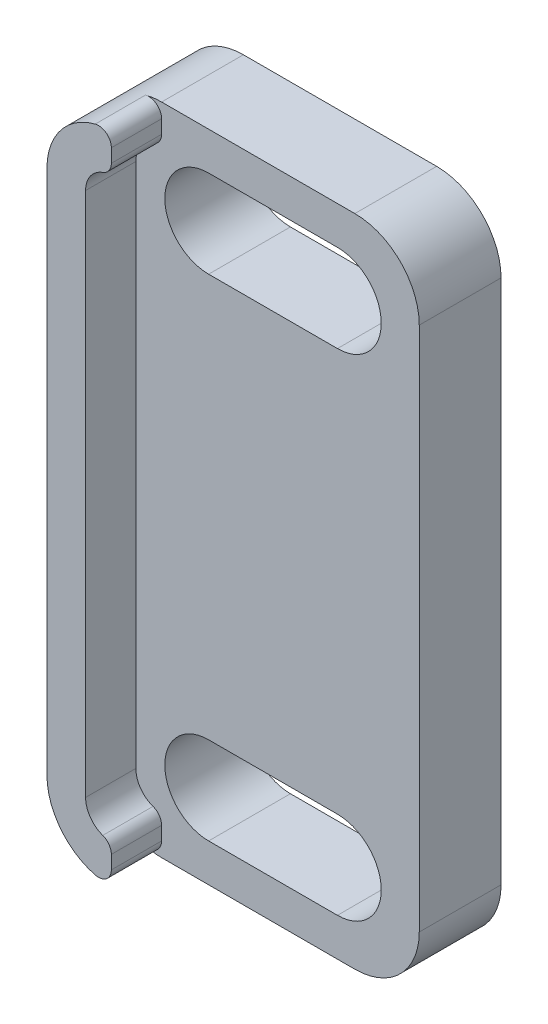
ISO-10303-21;
HEADER;
FILE_DESCRIPTION(('STEP AP214'),'2;1');
FILE_NAME('part.step','',(''),(''),'','','');
FILE_SCHEMA(('AUTOMOTIVE_DESIGN { 1 0 10303 214 1 1 1 1 }'));
ENDSEC;
DATA;
#1=APPLICATION_CONTEXT('core data for automotive mechanical design processes');
#2=APPLICATION_PROTOCOL_DEFINITION('international standard','automotive_design',2000,#1);
#3=PRODUCT_CONTEXT('',#1,'mechanical');
#4=PRODUCT('Part','Part','',(#3));
#5=PRODUCT_RELATED_PRODUCT_CATEGORY('part','',(#4));
#6=PRODUCT_DEFINITION_FORMATION('','',#4);
#7=PRODUCT_DEFINITION_CONTEXT('part definition',#1,'design');
#8=PRODUCT_DEFINITION('design','',#6,#7);
#9=PRODUCT_DEFINITION_SHAPE('','',#8);
#10=(LENGTH_UNIT() NAMED_UNIT(*) SI_UNIT(.MILLI.,.METRE.));
#11=(NAMED_UNIT(*) PLANE_ANGLE_UNIT() SI_UNIT($,.RADIAN.));
#12=(NAMED_UNIT(*) SI_UNIT($,.STERADIAN.) SOLID_ANGLE_UNIT());
#13=UNCERTAINTY_MEASURE_WITH_UNIT(LENGTH_MEASURE(1.E-05),#10,'distance_accuracy_value','');
#14=(GEOMETRIC_REPRESENTATION_CONTEXT(3) GLOBAL_UNCERTAINTY_ASSIGNED_CONTEXT((#13)) GLOBAL_UNIT_ASSIGNED_CONTEXT((#10,
#11,#12)) REPRESENTATION_CONTEXT('',''));
#15=CARTESIAN_POINT('',(0.,0.,0.));
#16=DIRECTION('',(0.,0.,1.));
#17=DIRECTION('',(1.,0.,0.));
#18=AXIS2_PLACEMENT_3D('',#15,#16,#17);
#19=CARTESIAN_POINT('',(0.,0.,3.175));
#20=DIRECTION('',(0.,0.,-1.));
#21=DIRECTION('',(-1.,0.,0.));
#22=AXIS2_PLACEMENT_3D('',#19,#20,#21);
#23=PLANE('',#22);
#24=CARTESIAN_POINT('',(4.325,22.225,3.175));
#25=DIRECTION('',(0.,0.,1.));
#26=DIRECTION('',(1.,0.,0.));
#27=AXIS2_PLACEMENT_3D('',#24,#25,#26);
#28=CIRCLE('',#27,1.7);
#29=CARTESIAN_POINT('',(4.325,23.925,3.175));
#30=VERTEX_POINT('',#29);
#31=CARTESIAN_POINT('',(4.325,20.525,3.175));
#32=VERTEX_POINT('',#31);
#33=EDGE_CURVE('E270',#30,#32,#28,.T.);
#34=ORIENTED_EDGE('',*,*,#33,.F.);
#35=DIRECTION('',(-1.,0.,0.));
#36=VECTOR('',#35,1.);
#37=CARTESIAN_POINT('',(4.325,23.925,3.175));
#38=LINE('',#37,#36);
#39=CARTESIAN_POINT('',(9.325,23.925,3.175));
#40=VERTEX_POINT('',#39);
#41=EDGE_CURVE('E278',#40,#30,#38,.T.);
#42=ORIENTED_EDGE('',*,*,#41,.F.);
#43=CARTESIAN_POINT('',(9.325,22.225,3.175));
#44=DIRECTION('',(0.,0.,1.));
#45=DIRECTION('',(1.,0.,0.));
#46=AXIS2_PLACEMENT_3D('',#43,#44,#45);
#47=CIRCLE('',#46,1.7);
#48=CARTESIAN_POINT('',(9.325,20.525,3.175));
#49=VERTEX_POINT('',#48);
#50=EDGE_CURVE('E275',#49,#40,#47,.T.);
#51=ORIENTED_EDGE('',*,*,#50,.F.);
#52=DIRECTION('',(1.,0.,0.));
#53=VECTOR('',#52,1.);
#54=CARTESIAN_POINT('',(4.325,20.525,3.175));
#55=LINE('',#54,#53);
#56=EDGE_CURVE('E272',#32,#49,#55,.T.);
#57=ORIENTED_EDGE('',*,*,#56,.F.);
#58=EDGE_LOOP('',(#34,#42,#51,#57));
#59=FACE_BOUND('',#58,.T.);
#60=CARTESIAN_POINT('',(4.325,3.175,3.175));
#61=DIRECTION('',(0.,0.,1.));
#62=DIRECTION('',(1.,0.,0.));
#63=AXIS2_PLACEMENT_3D('',#60,#61,#62);
#64=CIRCLE('',#63,1.7);
#65=CARTESIAN_POINT('',(4.325,4.875,3.175));
#66=VERTEX_POINT('',#65);
#67=CARTESIAN_POINT('',(4.325,1.475,3.175));
#68=VERTEX_POINT('',#67);
#69=EDGE_CURVE('E301',#66,#68,#64,.T.);
#70=ORIENTED_EDGE('',*,*,#69,.F.);
#71=DIRECTION('',(-1.,0.,0.));
#72=VECTOR('',#71,1.);
#73=CARTESIAN_POINT('',(4.325,4.875,3.175));
#74=LINE('',#73,#72);
#75=CARTESIAN_POINT('',(9.325,4.875,3.175));
#76=VERTEX_POINT('',#75);
#77=EDGE_CURVE('E309',#76,#66,#74,.T.);
#78=ORIENTED_EDGE('',*,*,#77,.F.);
#79=CARTESIAN_POINT('',(9.325,3.175,3.175));
#80=DIRECTION('',(0.,0.,1.));
#81=DIRECTION('',(1.,0.,0.));
#82=AXIS2_PLACEMENT_3D('',#79,#80,#81);
#83=CIRCLE('',#82,1.7);
#84=CARTESIAN_POINT('',(9.325,1.475,3.175));
#85=VERTEX_POINT('',#84);
#86=EDGE_CURVE('E306',#85,#76,#83,.T.);
#87=ORIENTED_EDGE('',*,*,#86,.F.);
#88=DIRECTION('',(1.,0.,0.));
#89=VECTOR('',#88,1.);
#90=CARTESIAN_POINT('',(4.325,1.475,3.175));
#91=LINE('',#90,#89);
#92=EDGE_CURVE('E303',#68,#85,#91,.T.);
#93=ORIENTED_EDGE('',*,*,#92,.F.);
#94=EDGE_LOOP('',(#70,#78,#87,#93));
#95=FACE_BOUND('',#94,.T.);
#96=DIRECTION('',(0.,1.,0.));
#97=VECTOR('',#96,1.);
#98=CARTESIAN_POINT('',(2.5,23.9,3.175));
#99=LINE('',#98,#97);
#100=CARTESIAN_POINT('',(2.5,24.3142135623731,3.175));
#101=VERTEX_POINT('',#100);
#102=CARTESIAN_POINT('',(2.5,24.8364916731037,3.175));
#103=VERTEX_POINT('',#102);
#104=EDGE_CURVE('E219',#101,#103,#99,.T.);
#105=ORIENTED_EDGE('',*,*,#104,.F.);
#106=CARTESIAN_POINT('',(2.,24.3142135623731,3.175));
#107=DIRECTION('',(0.,0.,-1.));
#108=DIRECTION('',(-1.,0.,0.));
#109=AXIS2_PLACEMENT_3D('',#106,#107,#108);
#110=CIRCLE('',#109,0.5);
#111=CARTESIAN_POINT('',(2.16666666666667,23.8428090415821,3.175));
#112=VERTEX_POINT('',#111);
#113=EDGE_CURVE('E42',#101,#112,#110,.T.);
#114=ORIENTED_EDGE('',*,*,#113,.T.);
#115=CARTESIAN_POINT('',(2.5,22.9,3.175));
#116=DIRECTION('',(0.,0.,1.));
#117=DIRECTION('',(1.,0.,0.));
#118=AXIS2_PLACEMENT_3D('',#115,#116,#117);
#119=CIRCLE('',#118,1.);
#120=CARTESIAN_POINT('',(1.5,22.9,3.175));
#121=VERTEX_POINT('',#120);
#122=EDGE_CURVE('E261',#112,#121,#119,.T.);
#123=ORIENTED_EDGE('',*,*,#122,.T.);
#124=DIRECTION('',(0.,-1.,0.));
#125=VECTOR('',#124,1.);
#126=CARTESIAN_POINT('',(1.5,22.9,3.175));
#127=LINE('',#126,#125);
#128=CARTESIAN_POINT('',(1.5,2.5,3.175));
#129=VERTEX_POINT('',#128);
#130=EDGE_CURVE('E258',#121,#129,#127,.T.);
#131=ORIENTED_EDGE('',*,*,#130,.T.);
#132=CARTESIAN_POINT('',(2.5,2.5,3.175));
#133=DIRECTION('',(0.,0.,1.));
#134=DIRECTION('',(1.,0.,0.));
#135=AXIS2_PLACEMENT_3D('',#132,#133,#134);
#136=CIRCLE('',#135,1.);
#137=CARTESIAN_POINT('',(2.16666666666667,1.55719095841794,3.175));
#138=VERTEX_POINT('',#137);
#139=EDGE_CURVE('E255',#129,#138,#136,.T.);
#140=ORIENTED_EDGE('',*,*,#139,.T.);
#141=CARTESIAN_POINT('',(2.,1.08578643762691,3.175));
#142=DIRECTION('',(0.,0.,-1.));
#143=DIRECTION('',(-1.,0.,0.));
#144=AXIS2_PLACEMENT_3D('',#141,#142,#143);
#145=CIRCLE('',#144,0.5);
#146=CARTESIAN_POINT('',(2.5,1.08578643762691,3.175));
#147=VERTEX_POINT('',#146);
#148=EDGE_CURVE('E408',#138,#147,#145,.T.);
#149=ORIENTED_EDGE('',*,*,#148,.T.);
#150=DIRECTION('',(0.,-1.,0.));
#151=VECTOR('',#150,1.);
#152=CARTESIAN_POINT('',(2.5,1.5,3.175));
#153=LINE('',#152,#151);
#154=CARTESIAN_POINT('',(2.5,0.563508326896292,3.175));
#155=VERTEX_POINT('',#154);
#156=EDGE_CURVE('E252',#147,#155,#153,.T.);
#157=ORIENTED_EDGE('',*,*,#156,.T.);
#158=CARTESIAN_POINT('',(2.,0.563508326896292,3.175));
#159=DIRECTION('',(0.,0.,-1.));
#160=DIRECTION('',(-1.,0.,0.));
#161=AXIS2_PLACEMENT_3D('',#158,#159,#160);
#162=CIRCLE('',#161,0.5);
#163=CARTESIAN_POINT('',(1.875,0.0793854086203644,3.175));
#164=VERTEX_POINT('',#163);
#165=EDGE_CURVE('E406',#155,#164,#162,.T.);
#166=ORIENTED_EDGE('',*,*,#165,.T.);
#167=CARTESIAN_POINT('',(2.5,2.5,3.175));
#168=DIRECTION('',(0.,0.,-1.));
#169=DIRECTION('',(-1.,0.,0.));
#170=AXIS2_PLACEMENT_3D('',#167,#168,#169);
#171=CIRCLE('',#170,2.5);
#172=CARTESIAN_POINT('',(2.5,0.,3.175));
#173=VERTEX_POINT('',#172);
#174=EDGE_CURVE('E49',#173,#164,#171,.T.);
#175=ORIENTED_EDGE('',*,*,#174,.F.);
#176=DIRECTION('',(1.,0.,0.));
#177=VECTOR('',#176,1.);
#178=CARTESIAN_POINT('',(0.,0.,3.175));
#179=LINE('',#178,#177);
#180=CARTESIAN_POINT('',(10.,0.,3.175));
#181=VERTEX_POINT('',#180);
#182=EDGE_CURVE('E332',#173,#181,#179,.T.);
#183=ORIENTED_EDGE('',*,*,#182,.T.);
#184=CARTESIAN_POINT('',(10.,2.5,3.175));
#185=DIRECTION('',(0.,0.,-1.));
#186=DIRECTION('',(-1.,0.,0.));
#187=AXIS2_PLACEMENT_3D('',#184,#185,#186);
#188=CIRCLE('',#187,2.5);
#189=CARTESIAN_POINT('',(12.5,2.5,3.175));
#190=VERTEX_POINT('',#189);
#191=EDGE_CURVE('E364',#181,#190,#188,.F.);
#192=ORIENTED_EDGE('',*,*,#191,.T.);
#193=DIRECTION('',(0.,1.,0.));
#194=VECTOR('',#193,1.);
#195=CARTESIAN_POINT('',(12.5,0.,3.175));
#196=LINE('',#195,#194);
#197=CARTESIAN_POINT('',(12.5,22.9,3.175));
#198=VERTEX_POINT('',#197);
#199=EDGE_CURVE('E334',#190,#198,#196,.T.);
#200=ORIENTED_EDGE('',*,*,#199,.T.);
#201=CARTESIAN_POINT('',(10.,22.9,3.175));
#202=DIRECTION('',(0.,0.,-1.));
#203=DIRECTION('',(-1.,0.,0.));
#204=AXIS2_PLACEMENT_3D('',#201,#202,#203);
#205=CIRCLE('',#204,2.5);
#206=CARTESIAN_POINT('',(10.,25.4,3.175));
#207=VERTEX_POINT('',#206);
#208=EDGE_CURVE('E362',#198,#207,#205,.F.);
#209=ORIENTED_EDGE('',*,*,#208,.T.);
#210=DIRECTION('',(-1.,0.,0.));
#211=VECTOR('',#210,1.);
#212=CARTESIAN_POINT('',(0.,25.4,3.175));
#213=LINE('',#212,#211);
#214=CARTESIAN_POINT('',(2.5,25.4,3.175));
#215=VERTEX_POINT('',#214);
#216=EDGE_CURVE('E338',#207,#215,#213,.T.);
#217=ORIENTED_EDGE('',*,*,#216,.T.);
#218=CARTESIAN_POINT('',(2.5,22.9,3.175));
#219=DIRECTION('',(0.,0.,-1.));
#220=DIRECTION('',(-1.,0.,0.));
#221=AXIS2_PLACEMENT_3D('',#218,#219,#220);
#222=CIRCLE('',#221,2.5);
#223=CARTESIAN_POINT('',(1.875,25.3206145913796,3.175));
#224=VERTEX_POINT('',#223);
#225=EDGE_CURVE('E402',#224,#215,#222,.T.);
#226=ORIENTED_EDGE('',*,*,#225,.F.);
#227=CARTESIAN_POINT('',(2.,24.8364916731037,3.175));
#228=DIRECTION('',(0.,0.,-1.));
#229=DIRECTION('',(-1.,0.,0.));
#230=AXIS2_PLACEMENT_3D('',#227,#228,#229);
#231=CIRCLE('',#230,0.5);
#232=EDGE_CURVE('E11',#224,#103,#231,.T.);
#233=ORIENTED_EDGE('',*,*,#232,.T.);
#234=EDGE_LOOP('',(#105,#114,#123,#131,#140,#149,#157,#166,#175,#183,#192,#200,#209,#217,#226,#233));
#235=FACE_BOUND('',#234,.T.);
#236=ADVANCED_FACE('F34',(#59,#95,#235),#23,.F.);
#237=CARTESIAN_POINT('',(0.,0.,0.));
#238=DIRECTION('',(0.,0.,-1.));
#239=DIRECTION('',(-1.,0.,0.));
#240=AXIS2_PLACEMENT_3D('',#237,#238,#239);
#241=PLANE('',#240);
#242=DIRECTION('',(1.,0.,0.));
#243=VECTOR('',#242,1.);
#244=CARTESIAN_POINT('',(0.,0.,0.));
#245=LINE('',#244,#243);
#246=CARTESIAN_POINT('',(2.5,0.,0.));
#247=VERTEX_POINT('',#246);
#248=CARTESIAN_POINT('',(10.,0.,0.));
#249=VERTEX_POINT('',#248);
#250=EDGE_CURVE('E343',#247,#249,#245,.T.);
#251=ORIENTED_EDGE('',*,*,#250,.F.);
#252=CARTESIAN_POINT('',(2.5,2.5,0.));
#253=DIRECTION('',(0.,0.,-1.));
#254=DIRECTION('',(-1.,0.,0.));
#255=AXIS2_PLACEMENT_3D('',#252,#253,#254);
#256=CIRCLE('',#255,2.5);
#257=CARTESIAN_POINT('',(0.,2.5,0.));
#258=VERTEX_POINT('',#257);
#259=EDGE_CURVE('E230',#247,#258,#256,.T.);
#260=ORIENTED_EDGE('',*,*,#259,.T.);
#261=DIRECTION('',(0.,-1.,0.));
#262=VECTOR('',#261,1.);
#263=CARTESIAN_POINT('',(0.,0.,0.));
#264=LINE('',#263,#262);
#265=CARTESIAN_POINT('',(0.,22.9,0.));
#266=VERTEX_POINT('',#265);
#267=EDGE_CURVE('E331',#266,#258,#264,.T.);
#268=ORIENTED_EDGE('',*,*,#267,.F.);
#269=CARTESIAN_POINT('',(2.5,22.9,0.));
#270=DIRECTION('',(0.,0.,-1.));
#271=DIRECTION('',(-1.,0.,0.));
#272=AXIS2_PLACEMENT_3D('',#269,#270,#271);
#273=CIRCLE('',#272,2.5);
#274=CARTESIAN_POINT('',(2.5,25.4,0.));
#275=VERTEX_POINT('',#274);
#276=EDGE_CURVE('E225',#266,#275,#273,.T.);
#277=ORIENTED_EDGE('',*,*,#276,.T.);
#278=DIRECTION('',(-1.,0.,0.));
#279=VECTOR('',#278,1.);
#280=CARTESIAN_POINT('',(0.,25.4,0.));
#281=LINE('',#280,#279);
#282=CARTESIAN_POINT('',(10.,25.4,0.));
#283=VERTEX_POINT('',#282);
#284=EDGE_CURVE('E335',#283,#275,#281,.T.);
#285=ORIENTED_EDGE('',*,*,#284,.F.);
#286=CARTESIAN_POINT('',(10.,22.9,0.));
#287=DIRECTION('',(0.,0.,-1.));
#288=DIRECTION('',(-1.,0.,0.));
#289=AXIS2_PLACEMENT_3D('',#286,#287,#288);
#290=CIRCLE('',#289,2.5);
#291=CARTESIAN_POINT('',(12.5,22.9,0.));
#292=VERTEX_POINT('',#291);
#293=EDGE_CURVE('E356',#283,#292,#290,.T.);
#294=ORIENTED_EDGE('',*,*,#293,.T.);
#295=DIRECTION('',(0.,1.,0.));
#296=VECTOR('',#295,1.);
#297=CARTESIAN_POINT('',(12.5,0.,0.));
#298=LINE('',#297,#296);
#299=CARTESIAN_POINT('',(12.5,2.5,0.));
#300=VERTEX_POINT('',#299);
#301=EDGE_CURVE('E346',#300,#292,#298,.T.);
#302=ORIENTED_EDGE('',*,*,#301,.F.);
#303=CARTESIAN_POINT('',(10.,2.5,0.));
#304=DIRECTION('',(0.,0.,-1.));
#305=DIRECTION('',(-1.,0.,0.));
#306=AXIS2_PLACEMENT_3D('',#303,#304,#305);
#307=CIRCLE('',#306,2.5);
#308=EDGE_CURVE('E358',#300,#249,#307,.T.);
#309=ORIENTED_EDGE('',*,*,#308,.T.);
#310=EDGE_LOOP('',(#251,#260,#268,#277,#285,#294,#302,#309));
#311=FACE_BOUND('',#310,.T.);
#312=DIRECTION('',(-1.,0.,0.));
#313=VECTOR('',#312,1.);
#314=CARTESIAN_POINT('',(4.325,4.875,0.));
#315=LINE('',#314,#313);
#316=CARTESIAN_POINT('',(9.325,4.875,0.));
#317=VERTEX_POINT('',#316);
#318=CARTESIAN_POINT('',(4.325,4.875,0.));
#319=VERTEX_POINT('',#318);
#320=EDGE_CURVE('E304',#317,#319,#315,.T.);
#321=ORIENTED_EDGE('',*,*,#320,.T.);
#322=CARTESIAN_POINT('',(4.325,3.175,0.));
#323=DIRECTION('',(0.,0.,1.));
#324=DIRECTION('',(1.,0.,0.));
#325=AXIS2_PLACEMENT_3D('',#322,#323,#324);
#326=CIRCLE('',#325,1.7);
#327=CARTESIAN_POINT('',(4.325,1.475,0.));
#328=VERTEX_POINT('',#327);
#329=EDGE_CURVE('E300',#319,#328,#326,.T.);
#330=ORIENTED_EDGE('',*,*,#329,.T.);
#331=DIRECTION('',(1.,0.,0.));
#332=VECTOR('',#331,1.);
#333=CARTESIAN_POINT('',(4.325,1.475,0.));
#334=LINE('',#333,#332);
#335=CARTESIAN_POINT('',(9.325,1.475,0.));
#336=VERTEX_POINT('',#335);
#337=EDGE_CURVE('E314',#328,#336,#334,.T.);
#338=ORIENTED_EDGE('',*,*,#337,.T.);
#339=CARTESIAN_POINT('',(9.325,3.175,0.));
#340=DIRECTION('',(0.,0.,1.));
#341=DIRECTION('',(1.,0.,0.));
#342=AXIS2_PLACEMENT_3D('',#339,#340,#341);
#343=CIRCLE('',#342,1.7);
#344=EDGE_CURVE('E317',#336,#317,#343,.T.);
#345=ORIENTED_EDGE('',*,*,#344,.T.);
#346=EDGE_LOOP('',(#321,#330,#338,#345));
#347=FACE_BOUND('',#346,.T.);
#348=DIRECTION('',(-1.,0.,0.));
#349=VECTOR('',#348,1.);
#350=CARTESIAN_POINT('',(4.325,23.925,0.));
#351=LINE('',#350,#349);
#352=CARTESIAN_POINT('',(9.325,23.925,0.));
#353=VERTEX_POINT('',#352);
#354=CARTESIAN_POINT('',(4.325,23.925,0.));
#355=VERTEX_POINT('',#354);
#356=EDGE_CURVE('E273',#353,#355,#351,.T.);
#357=ORIENTED_EDGE('',*,*,#356,.T.);
#358=CARTESIAN_POINT('',(4.325,22.225,0.));
#359=DIRECTION('',(0.,0.,1.));
#360=DIRECTION('',(1.,0.,0.));
#361=AXIS2_PLACEMENT_3D('',#358,#359,#360);
#362=CIRCLE('',#361,1.7);
#363=CARTESIAN_POINT('',(4.325,20.525,0.));
#364=VERTEX_POINT('',#363);
#365=EDGE_CURVE('E269',#355,#364,#362,.T.);
#366=ORIENTED_EDGE('',*,*,#365,.T.);
#367=DIRECTION('',(1.,0.,0.));
#368=VECTOR('',#367,1.);
#369=CARTESIAN_POINT('',(4.325,20.525,0.));
#370=LINE('',#369,#368);
#371=CARTESIAN_POINT('',(9.325,20.525,0.));
#372=VERTEX_POINT('',#371);
#373=EDGE_CURVE('E283',#364,#372,#370,.T.);
#374=ORIENTED_EDGE('',*,*,#373,.T.);
#375=CARTESIAN_POINT('',(9.325,22.225,0.));
#376=DIRECTION('',(0.,0.,1.));
#377=DIRECTION('',(1.,0.,0.));
#378=AXIS2_PLACEMENT_3D('',#375,#376,#377);
#379=CIRCLE('',#378,1.7);
#380=EDGE_CURVE('E286',#372,#353,#379,.T.);
#381=ORIENTED_EDGE('',*,*,#380,.T.);
#382=EDGE_LOOP('',(#357,#366,#374,#381));
#383=FACE_BOUND('',#382,.T.);
#384=ADVANCED_FACE('F437',(#311,#347,#383),#241,.T.);
#385=CARTESIAN_POINT('',(0.,0.,3.175));
#386=DIRECTION('',(1.,0.,0.));
#387=DIRECTION('',(0.,0.,-1.));
#388=AXIS2_PLACEMENT_3D('',#385,#386,#387);
#389=PLANE('',#388);
#390=ORIENTED_EDGE('',*,*,#267,.T.);
#391=DIRECTION('',(0.,0.,-1.));
#392=VECTOR('',#391,1.);
#393=CARTESIAN_POINT('',(0.,2.5,3.175));
#394=LINE('',#393,#392);
#395=CARTESIAN_POINT('',(0.,2.5,5.125));
#396=VERTEX_POINT('',#395);
#397=EDGE_CURVE('E229',#258,#396,#394,.F.);
#398=ORIENTED_EDGE('',*,*,#397,.T.);
#399=DIRECTION('',(0.,-1.,0.));
#400=VECTOR('',#399,1.);
#401=CARTESIAN_POINT('',(0.,22.9,5.125));
#402=LINE('',#401,#400);
#403=CARTESIAN_POINT('',(0.,22.9,5.125));
#404=VERTEX_POINT('',#403);
#405=EDGE_CURVE('E212',#404,#396,#402,.T.);
#406=ORIENTED_EDGE('',*,*,#405,.F.);
#407=DIRECTION('',(0.,0.,-1.));
#408=VECTOR('',#407,1.);
#409=CARTESIAN_POINT('',(0.,22.9,3.175));
#410=LINE('',#409,#408);
#411=EDGE_CURVE('E222',#404,#266,#410,.T.);
#412=ORIENTED_EDGE('',*,*,#411,.T.);
#413=EDGE_LOOP('',(#390,#398,#406,#412));
#414=FACE_BOUND('',#413,.T.);
#415=ADVANCED_FACE('F232',(#414),#389,.F.);
#416=CARTESIAN_POINT('',(0.,0.,3.175));
#417=DIRECTION('',(0.,1.,0.));
#418=DIRECTION('',(0.,0.,1.));
#419=AXIS2_PLACEMENT_3D('',#416,#417,#418);
#420=PLANE('',#419);
#421=ORIENTED_EDGE('',*,*,#182,.F.);
#422=DIRECTION('',(0.,0.,-1.));
#423=VECTOR('',#422,1.);
#424=CARTESIAN_POINT('',(2.5,0.,3.175));
#425=LINE('',#424,#423);
#426=EDGE_CURVE('E352',#173,#247,#425,.T.);
#427=ORIENTED_EDGE('',*,*,#426,.T.);
#428=ORIENTED_EDGE('',*,*,#250,.T.);
#429=DIRECTION('',(0.,0.,-1.));
#430=VECTOR('',#429,1.);
#431=CARTESIAN_POINT('',(10.,0.,3.175));
#432=LINE('',#431,#430);
#433=EDGE_CURVE('E341',#249,#181,#432,.F.);
#434=ORIENTED_EDGE('',*,*,#433,.T.);
#435=EDGE_LOOP('',(#421,#427,#428,#434));
#436=FACE_BOUND('',#435,.T.);
#437=ADVANCED_FACE('F488',(#436),#420,.F.);
#438=CARTESIAN_POINT('',(12.5,0.,3.175));
#439=DIRECTION('',(-1.,0.,0.));
#440=DIRECTION('',(0.,0.,1.));
#441=AXIS2_PLACEMENT_3D('',#438,#439,#440);
#442=PLANE('',#441);
#443=ORIENTED_EDGE('',*,*,#199,.F.);
#444=DIRECTION('',(0.,0.,-1.));
#445=VECTOR('',#444,1.);
#446=CARTESIAN_POINT('',(12.5,2.5,3.175));
#447=LINE('',#446,#445);
#448=EDGE_CURVE('E368',#190,#300,#447,.T.);
#449=ORIENTED_EDGE('',*,*,#448,.T.);
#450=ORIENTED_EDGE('',*,*,#301,.T.);
#451=DIRECTION('',(0.,0.,-1.));
#452=VECTOR('',#451,1.);
#453=CARTESIAN_POINT('',(12.5,22.9,3.175));
#454=LINE('',#453,#452);
#455=EDGE_CURVE('E366',#292,#198,#454,.F.);
#456=ORIENTED_EDGE('',*,*,#455,.T.);
#457=EDGE_LOOP('',(#443,#449,#450,#456));
#458=FACE_BOUND('',#457,.T.);
#459=ADVANCED_FACE('F485',(#458),#442,.F.);
#460=CARTESIAN_POINT('',(0.,25.4,3.175));
#461=DIRECTION('',(0.,-1.,0.));
#462=DIRECTION('',(0.,0.,-1.));
#463=AXIS2_PLACEMENT_3D('',#460,#461,#462);
#464=PLANE('',#463);
#465=ORIENTED_EDGE('',*,*,#216,.F.);
#466=DIRECTION('',(0.,0.,-1.));
#467=VECTOR('',#466,1.);
#468=CARTESIAN_POINT('',(10.,25.4,3.175));
#469=LINE('',#468,#467);
#470=EDGE_CURVE('E374',#207,#283,#469,.T.);
#471=ORIENTED_EDGE('',*,*,#470,.T.);
#472=ORIENTED_EDGE('',*,*,#284,.T.);
#473=DIRECTION('',(0.,0.,-1.));
#474=VECTOR('',#473,1.);
#475=CARTESIAN_POINT('',(2.5,25.4,3.175));
#476=LINE('',#475,#474);
#477=EDGE_CURVE('E371',#275,#215,#476,.F.);
#478=ORIENTED_EDGE('',*,*,#477,.T.);
#479=EDGE_LOOP('',(#465,#471,#472,#478));
#480=FACE_BOUND('',#479,.T.);
#481=ADVANCED_FACE('F427',(#480),#464,.F.);
#482=CARTESIAN_POINT('',(4.325,3.175,3.175));
#483=DIRECTION('',(0.,0.,-1.));
#484=DIRECTION('',(-1.,0.,0.));
#485=AXIS2_PLACEMENT_3D('',#482,#483,#484);
#486=CYLINDRICAL_SURFACE('',#485,1.7);
#487=ORIENTED_EDGE('',*,*,#329,.F.);
#488=DIRECTION('',(0.,0.,-1.));
#489=VECTOR('',#488,1.);
#490=CARTESIAN_POINT('',(4.325,4.875,3.175));
#491=LINE('',#490,#489);
#492=EDGE_CURVE('E311',#66,#319,#491,.T.);
#493=ORIENTED_EDGE('',*,*,#492,.F.);
#494=ORIENTED_EDGE('',*,*,#69,.T.);
#495=DIRECTION('',(0.,0.,-1.));
#496=VECTOR('',#495,1.);
#497=CARTESIAN_POINT('',(4.325,1.475,3.175));
#498=LINE('',#497,#496);
#499=EDGE_CURVE('E328',#68,#328,#498,.T.);
#500=ORIENTED_EDGE('',*,*,#499,.T.);
#501=EDGE_LOOP('',(#487,#493,#494,#500));
#502=FACE_BOUND('',#501,.T.);
#503=ADVANCED_FACE('F480',(#502),#486,.F.);
#504=CARTESIAN_POINT('',(4.325,1.475,3.175));
#505=DIRECTION('',(0.,1.,0.));
#506=DIRECTION('',(-1.,0.,0.));
#507=AXIS2_PLACEMENT_3D('',#504,#505,#506);
#508=PLANE('',#507);
#509=ORIENTED_EDGE('',*,*,#337,.F.);
#510=ORIENTED_EDGE('',*,*,#499,.F.);
#511=ORIENTED_EDGE('',*,*,#92,.T.);
#512=DIRECTION('',(0.,0.,-1.));
#513=VECTOR('',#512,1.);
#514=CARTESIAN_POINT('',(9.325,1.475,3.175));
#515=LINE('',#514,#513);
#516=EDGE_CURVE('E326',#85,#336,#515,.T.);
#517=ORIENTED_EDGE('',*,*,#516,.T.);
#518=EDGE_LOOP('',(#509,#510,#511,#517));
#519=FACE_BOUND('',#518,.T.);
#520=ADVANCED_FACE('F695',(#519),#508,.T.);
#521=CARTESIAN_POINT('',(9.325,3.175,3.175));
#522=DIRECTION('',(0.,0.,-1.));
#523=DIRECTION('',(-1.,0.,0.));
#524=AXIS2_PLACEMENT_3D('',#521,#522,#523);
#525=CYLINDRICAL_SURFACE('',#524,1.7);
#526=ORIENTED_EDGE('',*,*,#344,.F.);
#527=ORIENTED_EDGE('',*,*,#516,.F.);
#528=ORIENTED_EDGE('',*,*,#86,.T.);
#529=DIRECTION('',(0.,0.,-1.));
#530=VECTOR('',#529,1.);
#531=CARTESIAN_POINT('',(9.325,4.875,3.175));
#532=LINE('',#531,#530);
#533=EDGE_CURVE('E324',#76,#317,#532,.T.);
#534=ORIENTED_EDGE('',*,*,#533,.T.);
#535=EDGE_LOOP('',(#526,#527,#528,#534));
#536=FACE_BOUND('',#535,.T.);
#537=ADVANCED_FACE('F685',(#536),#525,.F.);
#538=CARTESIAN_POINT('',(4.325,4.875,3.175));
#539=DIRECTION('',(0.,-1.,0.));
#540=DIRECTION('',(1.,0.,0.));
#541=AXIS2_PLACEMENT_3D('',#538,#539,#540);
#542=PLANE('',#541);
#543=ORIENTED_EDGE('',*,*,#320,.F.);
#544=ORIENTED_EDGE('',*,*,#533,.F.);
#545=ORIENTED_EDGE('',*,*,#77,.T.);
#546=ORIENTED_EDGE('',*,*,#492,.T.);
#547=EDGE_LOOP('',(#543,#544,#545,#546));
#548=FACE_BOUND('',#547,.T.);
#549=ADVANCED_FACE('F675',(#548),#542,.T.);
#550=CARTESIAN_POINT('',(4.325,22.225,3.175));
#551=DIRECTION('',(0.,0.,-1.));
#552=DIRECTION('',(-1.,0.,0.));
#553=AXIS2_PLACEMENT_3D('',#550,#551,#552);
#554=CYLINDRICAL_SURFACE('',#553,1.7);
#555=ORIENTED_EDGE('',*,*,#365,.F.);
#556=DIRECTION('',(0.,0.,-1.));
#557=VECTOR('',#556,1.);
#558=CARTESIAN_POINT('',(4.325,23.925,3.175));
#559=LINE('',#558,#557);
#560=EDGE_CURVE('E280',#30,#355,#559,.T.);
#561=ORIENTED_EDGE('',*,*,#560,.F.);
#562=ORIENTED_EDGE('',*,*,#33,.T.);
#563=DIRECTION('',(0.,0.,-1.));
#564=VECTOR('',#563,1.);
#565=CARTESIAN_POINT('',(4.325,20.525,3.175));
#566=LINE('',#565,#564);
#567=EDGE_CURVE('E297',#32,#364,#566,.T.);
#568=ORIENTED_EDGE('',*,*,#567,.T.);
#569=EDGE_LOOP('',(#555,#561,#562,#568));
#570=FACE_BOUND('',#569,.T.);
#571=ADVANCED_FACE('F665',(#570),#554,.F.);
#572=CARTESIAN_POINT('',(4.325,20.525,3.175));
#573=DIRECTION('',(0.,1.,0.));
#574=DIRECTION('',(0.,0.,1.));
#575=AXIS2_PLACEMENT_3D('',#572,#573,#574);
#576=PLANE('',#575);
#577=ORIENTED_EDGE('',*,*,#373,.F.);
#578=ORIENTED_EDGE('',*,*,#567,.F.);
#579=ORIENTED_EDGE('',*,*,#56,.T.);
#580=DIRECTION('',(0.,0.,-1.));
#581=VECTOR('',#580,1.);
#582=CARTESIAN_POINT('',(9.325,20.525,3.175));
#583=LINE('',#582,#581);
#584=EDGE_CURVE('E295',#49,#372,#583,.T.);
#585=ORIENTED_EDGE('',*,*,#584,.T.);
#586=EDGE_LOOP('',(#577,#578,#579,#585));
#587=FACE_BOUND('',#586,.T.);
#588=ADVANCED_FACE('F655',(#587),#576,.T.);
#589=CARTESIAN_POINT('',(9.325,22.225,3.175));
#590=DIRECTION('',(0.,0.,-1.));
#591=DIRECTION('',(-1.,0.,0.));
#592=AXIS2_PLACEMENT_3D('',#589,#590,#591);
#593=CYLINDRICAL_SURFACE('',#592,1.7);
#594=ORIENTED_EDGE('',*,*,#380,.F.);
#595=ORIENTED_EDGE('',*,*,#584,.F.);
#596=ORIENTED_EDGE('',*,*,#50,.T.);
#597=DIRECTION('',(0.,0.,-1.));
#598=VECTOR('',#597,1.);
#599=CARTESIAN_POINT('',(9.325,23.925,3.175));
#600=LINE('',#599,#598);
#601=EDGE_CURVE('E293',#40,#353,#600,.T.);
#602=ORIENTED_EDGE('',*,*,#601,.T.);
#603=EDGE_LOOP('',(#594,#595,#596,#602));
#604=FACE_BOUND('',#603,.T.);
#605=ADVANCED_FACE('F645',(#604),#593,.F.);
#606=CARTESIAN_POINT('',(4.325,23.925,3.175));
#607=DIRECTION('',(0.,-1.,0.));
#608=DIRECTION('',(0.,0.,-1.));
#609=AXIS2_PLACEMENT_3D('',#606,#607,#608);
#610=PLANE('',#609);
#611=ORIENTED_EDGE('',*,*,#356,.F.);
#612=ORIENTED_EDGE('',*,*,#601,.F.);
#613=ORIENTED_EDGE('',*,*,#41,.T.);
#614=ORIENTED_EDGE('',*,*,#560,.T.);
#615=EDGE_LOOP('',(#611,#612,#613,#614));
#616=FACE_BOUND('',#615,.T.);
#617=ADVANCED_FACE('F498',(#616),#610,.T.);
#618=CARTESIAN_POINT('',(2.5,2.5,3.175));
#619=DIRECTION('',(0.,0.,-1.));
#620=DIRECTION('',(-1.,0.,0.));
#621=AXIS2_PLACEMENT_3D('',#618,#619,#620);
#622=CYLINDRICAL_SURFACE('',#621,2.5);
#623=ORIENTED_EDGE('',*,*,#426,.F.);
#624=ORIENTED_EDGE('',*,*,#174,.T.);
#625=DIRECTION('',(0.,0.,-1.));
#626=VECTOR('',#625,1.);
#627=CARTESIAN_POINT('',(1.875,0.0793854086203645,3.175));
#628=LINE('',#627,#626);
#629=CARTESIAN_POINT('',(1.875,0.0793854086203645,5.125));
#630=VERTEX_POINT('',#629);
#631=EDGE_CURVE('E382',#164,#630,#628,.F.);
#632=ORIENTED_EDGE('',*,*,#631,.T.);
#633=CARTESIAN_POINT('',(2.5,2.5,5.125));
#634=DIRECTION('',(0.,0.,1.));
#635=DIRECTION('',(1.,0.,0.));
#636=AXIS2_PLACEMENT_3D('',#633,#634,#635);
#637=CIRCLE('',#636,2.5);
#638=EDGE_CURVE('E234',#396,#630,#637,.T.);
#639=ORIENTED_EDGE('',*,*,#638,.F.);
#640=ORIENTED_EDGE('',*,*,#397,.F.);
#641=ORIENTED_EDGE('',*,*,#259,.F.);
#642=EDGE_LOOP('',(#623,#624,#632,#639,#640,#641));
#643=FACE_BOUND('',#642,.T.);
#644=ADVANCED_FACE('F441',(#643),#622,.T.);
#645=CARTESIAN_POINT('',(10.,2.5,3.175));
#646=DIRECTION('',(0.,0.,-1.));
#647=DIRECTION('',(-1.,0.,0.));
#648=AXIS2_PLACEMENT_3D('',#645,#646,#647);
#649=CYLINDRICAL_SURFACE('',#648,2.5);
#650=ORIENTED_EDGE('',*,*,#191,.F.);
#651=ORIENTED_EDGE('',*,*,#433,.F.);
#652=ORIENTED_EDGE('',*,*,#308,.F.);
#653=ORIENTED_EDGE('',*,*,#448,.F.);
#654=EDGE_LOOP('',(#650,#651,#652,#653));
#655=FACE_BOUND('',#654,.T.);
#656=ADVANCED_FACE('F497',(#655),#649,.T.);
#657=CARTESIAN_POINT('',(10.,22.9,3.175));
#658=DIRECTION('',(0.,0.,-1.));
#659=DIRECTION('',(-1.,0.,0.));
#660=AXIS2_PLACEMENT_3D('',#657,#658,#659);
#661=CYLINDRICAL_SURFACE('',#660,2.5);
#662=ORIENTED_EDGE('',*,*,#208,.F.);
#663=ORIENTED_EDGE('',*,*,#455,.F.);
#664=ORIENTED_EDGE('',*,*,#293,.F.);
#665=ORIENTED_EDGE('',*,*,#470,.F.);
#666=EDGE_LOOP('',(#662,#663,#664,#665));
#667=FACE_BOUND('',#666,.T.);
#668=ADVANCED_FACE('F434',(#667),#661,.T.);
#669=CARTESIAN_POINT('',(2.5,22.9,3.175));
#670=DIRECTION('',(0.,0.,-1.));
#671=DIRECTION('',(-1.,0.,0.));
#672=AXIS2_PLACEMENT_3D('',#669,#670,#671);
#673=CYLINDRICAL_SURFACE('',#672,2.5);
#674=CARTESIAN_POINT('',(2.5,22.9,5.125));
#675=DIRECTION('',(0.,0.,1.));
#676=DIRECTION('',(1.,0.,0.));
#677=AXIS2_PLACEMENT_3D('',#674,#675,#676);
#678=CIRCLE('',#677,2.5);
#679=CARTESIAN_POINT('',(1.875,25.3206145913796,5.125));
#680=VERTEX_POINT('',#679);
#681=EDGE_CURVE('E207',#680,#404,#678,.T.);
#682=ORIENTED_EDGE('',*,*,#681,.F.);
#683=DIRECTION('',(0.,0.,-1.));
#684=VECTOR('',#683,1.);
#685=CARTESIAN_POINT('',(1.875,25.3206145913796,3.175));
#686=LINE('',#685,#684);
#687=EDGE_CURVE('E404',#680,#224,#686,.T.);
#688=ORIENTED_EDGE('',*,*,#687,.T.);
#689=ORIENTED_EDGE('',*,*,#225,.T.);
#690=ORIENTED_EDGE('',*,*,#477,.F.);
#691=ORIENTED_EDGE('',*,*,#276,.F.);
#692=ORIENTED_EDGE('',*,*,#411,.F.);
#693=EDGE_LOOP('',(#682,#688,#689,#690,#691,#692));
#694=FACE_BOUND('',#693,.T.);
#695=ADVANCED_FACE('F223',(#694),#673,.T.);
#696=CARTESIAN_POINT('',(2.5,1.5,5.125));
#697=DIRECTION('',(1.,0.,0.));
#698=DIRECTION('',(0.,0.,-1.));
#699=AXIS2_PLACEMENT_3D('',#696,#697,#698);
#700=PLANE('',#699);
#701=DIRECTION('',(0.,-1.,0.));
#702=VECTOR('',#701,1.);
#703=CARTESIAN_POINT('',(2.5,1.5,5.125));
#704=LINE('',#703,#702);
#705=CARTESIAN_POINT('',(2.5,1.08578643762691,5.125));
#706=VERTEX_POINT('',#705);
#707=CARTESIAN_POINT('',(2.5,0.563508326896292,5.125));
#708=VERTEX_POINT('',#707);
#709=EDGE_CURVE('E236',#706,#708,#704,.T.);
#710=ORIENTED_EDGE('',*,*,#709,.T.);
#711=DIRECTION('',(0.,0.,-1.));
#712=VECTOR('',#711,1.);
#713=CARTESIAN_POINT('',(2.5,0.563508326896292,5.125));
#714=LINE('',#713,#712);
#715=EDGE_CURVE('E379',#708,#155,#714,.T.);
#716=ORIENTED_EDGE('',*,*,#715,.T.);
#717=ORIENTED_EDGE('',*,*,#156,.F.);
#718=DIRECTION('',(0.,0.,-1.));
#719=VECTOR('',#718,1.);
#720=CARTESIAN_POINT('',(2.5,1.08578643762691,5.125));
#721=LINE('',#720,#719);
#722=EDGE_CURVE('E377',#147,#706,#721,.F.);
#723=ORIENTED_EDGE('',*,*,#722,.T.);
#724=EDGE_LOOP('',(#710,#716,#717,#723));
#725=FACE_BOUND('',#724,.T.);
#726=ADVANCED_FACE('F450',(#725),#700,.T.);
#727=CARTESIAN_POINT('',(2.5,2.5,5.125));
#728=DIRECTION('',(0.,0.,-1.));
#729=DIRECTION('',(-1.,0.,0.));
#730=AXIS2_PLACEMENT_3D('',#727,#728,#729);
#731=CYLINDRICAL_SURFACE('',#730,1.);
#732=CARTESIAN_POINT('',(2.5,2.5,5.125));
#733=DIRECTION('',(0.,0.,1.));
#734=DIRECTION('',(1.,0.,0.));
#735=AXIS2_PLACEMENT_3D('',#732,#733,#734);
#736=CIRCLE('',#735,1.);
#737=CARTESIAN_POINT('',(1.5,2.5,5.125));
#738=VERTEX_POINT('',#737);
#739=CARTESIAN_POINT('',(2.16666666666667,1.55719095841794,5.125));
#740=VERTEX_POINT('',#739);
#741=EDGE_CURVE('E241',#738,#740,#736,.T.);
#742=ORIENTED_EDGE('',*,*,#741,.T.);
#743=DIRECTION('',(0.,0.,-1.));
#744=VECTOR('',#743,1.);
#745=CARTESIAN_POINT('',(2.16666666666667,1.55719095841794,5.125));
#746=LINE('',#745,#744);
#747=EDGE_CURVE('E392',#740,#138,#746,.T.);
#748=ORIENTED_EDGE('',*,*,#747,.T.);
#749=ORIENTED_EDGE('',*,*,#139,.F.);
#750=DIRECTION('',(0.,0.,-1.));
#751=VECTOR('',#750,1.);
#752=CARTESIAN_POINT('',(1.5,2.5,5.125));
#753=LINE('',#752,#751);
#754=EDGE_CURVE('E267',#738,#129,#753,.T.);
#755=ORIENTED_EDGE('',*,*,#754,.F.);
#756=EDGE_LOOP('',(#742,#748,#749,#755));
#757=FACE_BOUND('',#756,.T.);
#758=ADVANCED_FACE('F458',(#757),#731,.F.);
#759=CARTESIAN_POINT('',(1.5,22.9,5.125));
#760=DIRECTION('',(1.,0.,0.));
#761=DIRECTION('',(0.,1.,0.));
#762=AXIS2_PLACEMENT_3D('',#759,#760,#761);
#763=PLANE('',#762);
#764=ORIENTED_EDGE('',*,*,#130,.F.);
#765=DIRECTION('',(0.,0.,-1.));
#766=VECTOR('',#765,1.);
#767=CARTESIAN_POINT('',(1.5,22.9,5.125));
#768=LINE('',#767,#766);
#769=CARTESIAN_POINT('',(1.5,22.9,5.125));
#770=VERTEX_POINT('',#769);
#771=EDGE_CURVE('E251',#770,#121,#768,.T.);
#772=ORIENTED_EDGE('',*,*,#771,.F.);
#773=DIRECTION('',(0.,-1.,0.));
#774=VECTOR('',#773,1.);
#775=CARTESIAN_POINT('',(1.5,22.9,5.125));
#776=LINE('',#775,#774);
#777=EDGE_CURVE('E244',#770,#738,#776,.T.);
#778=ORIENTED_EDGE('',*,*,#777,.T.);
#779=ORIENTED_EDGE('',*,*,#754,.T.);
#780=EDGE_LOOP('',(#764,#772,#778,#779));
#781=FACE_BOUND('',#780,.T.);
#782=ADVANCED_FACE('F461',(#781),#763,.T.);
#783=CARTESIAN_POINT('',(2.5,22.9,5.125));
#784=DIRECTION('',(0.,0.,-1.));
#785=DIRECTION('',(-1.,0.,0.));
#786=AXIS2_PLACEMENT_3D('',#783,#784,#785);
#787=CYLINDRICAL_SURFACE('',#786,1.);
#788=ORIENTED_EDGE('',*,*,#122,.F.);
#789=DIRECTION('',(0.,0.,-1.));
#790=VECTOR('',#789,1.);
#791=CARTESIAN_POINT('',(2.16666666666667,23.8428090415821,5.125));
#792=LINE('',#791,#790);
#793=CARTESIAN_POINT('',(2.16666666666667,23.8428090415821,5.125));
#794=VERTEX_POINT('',#793);
#795=EDGE_CURVE('E400',#112,#794,#792,.F.);
#796=ORIENTED_EDGE('',*,*,#795,.T.);
#797=CARTESIAN_POINT('',(2.5,22.9,5.125));
#798=DIRECTION('',(0.,0.,1.));
#799=DIRECTION('',(1.,0.,0.));
#800=AXIS2_PLACEMENT_3D('',#797,#798,#799);
#801=CIRCLE('',#800,1.);
#802=EDGE_CURVE('E247',#794,#770,#801,.T.);
#803=ORIENTED_EDGE('',*,*,#802,.T.);
#804=ORIENTED_EDGE('',*,*,#771,.T.);
#805=EDGE_LOOP('',(#788,#796,#803,#804));
#806=FACE_BOUND('',#805,.T.);
#807=ADVANCED_FACE('F415',(#806),#787,.F.);
#808=CARTESIAN_POINT('',(2.5,23.9,5.125));
#809=DIRECTION('',(-1.,0.,0.));
#810=DIRECTION('',(0.,0.,1.));
#811=AXIS2_PLACEMENT_3D('',#808,#809,#810);
#812=PLANE('',#811);
#813=DIRECTION('',(0.,1.,0.));
#814=VECTOR('',#813,1.);
#815=CARTESIAN_POINT('',(2.5,23.9,5.125));
#816=LINE('',#815,#814);
#817=CARTESIAN_POINT('',(2.5,24.3142135623731,5.125));
#818=VERTEX_POINT('',#817);
#819=CARTESIAN_POINT('',(2.5,24.8364916731037,5.125));
#820=VERTEX_POINT('',#819);
#821=EDGE_CURVE('E249',#818,#820,#816,.T.);
#822=ORIENTED_EDGE('',*,*,#821,.F.);
#823=DIRECTION('',(0.,0.,1.));
#824=VECTOR('',#823,1.);
#825=CARTESIAN_POINT('',(2.5,24.3142135623731,3.175));
#826=LINE('',#825,#824);
#827=EDGE_CURVE('E397',#818,#101,#826,.F.);
#828=ORIENTED_EDGE('',*,*,#827,.T.);
#829=ORIENTED_EDGE('',*,*,#104,.T.);
#830=DIRECTION('',(0.,0.,1.));
#831=VECTOR('',#830,1.);
#832=CARTESIAN_POINT('',(2.5,24.8364916731037,5.125));
#833=LINE('',#832,#831);
#834=EDGE_CURVE('E395',#103,#820,#833,.T.);
#835=ORIENTED_EDGE('',*,*,#834,.T.);
#836=EDGE_LOOP('',(#822,#828,#829,#835));
#837=FACE_BOUND('',#836,.T.);
#838=ADVANCED_FACE('F424',(#837),#812,.F.);
#839=CARTESIAN_POINT('',(2.5,22.9,5.125));
#840=DIRECTION('',(0.,0.,1.));
#841=DIRECTION('',(1.,0.,0.));
#842=AXIS2_PLACEMENT_3D('',#839,#840,#841);
#843=PLANE('',#842);
#844=ORIENTED_EDGE('',*,*,#638,.T.);
#845=CARTESIAN_POINT('',(2.,0.563508326896292,5.125));
#846=DIRECTION('',(0.,0.,1.));
#847=DIRECTION('',(1.,0.,0.));
#848=AXIS2_PLACEMENT_3D('',#845,#846,#847);
#849=CIRCLE('',#848,0.5);
#850=EDGE_CURVE('E390',#630,#708,#849,.T.);
#851=ORIENTED_EDGE('',*,*,#850,.T.);
#852=ORIENTED_EDGE('',*,*,#709,.F.);
#853=CARTESIAN_POINT('',(2.,1.08578643762691,5.125));
#854=DIRECTION('',(0.,0.,1.));
#855=DIRECTION('',(1.,0.,0.));
#856=AXIS2_PLACEMENT_3D('',#853,#854,#855);
#857=CIRCLE('',#856,0.5);
#858=EDGE_CURVE('E388',#706,#740,#857,.T.);
#859=ORIENTED_EDGE('',*,*,#858,.T.);
#860=ORIENTED_EDGE('',*,*,#741,.F.);
#861=ORIENTED_EDGE('',*,*,#777,.F.);
#862=ORIENTED_EDGE('',*,*,#802,.F.);
#863=CARTESIAN_POINT('',(2.,24.3142135623731,5.125));
#864=DIRECTION('',(0.,0.,1.));
#865=DIRECTION('',(1.,0.,0.));
#866=AXIS2_PLACEMENT_3D('',#863,#864,#865);
#867=CIRCLE('',#866,0.5);
#868=EDGE_CURVE('E386',#794,#818,#867,.T.);
#869=ORIENTED_EDGE('',*,*,#868,.T.);
#870=ORIENTED_EDGE('',*,*,#821,.T.);
#871=CARTESIAN_POINT('',(2.,24.8364916731037,5.125));
#872=DIRECTION('',(0.,0.,1.));
#873=DIRECTION('',(1.,0.,0.));
#874=AXIS2_PLACEMENT_3D('',#871,#872,#873);
#875=CIRCLE('',#874,0.5);
#876=EDGE_CURVE('E216',#820,#680,#875,.T.);
#877=ORIENTED_EDGE('',*,*,#876,.T.);
#878=ORIENTED_EDGE('',*,*,#681,.T.);
#879=ORIENTED_EDGE('',*,*,#405,.T.);
#880=EDGE_LOOP('',(#844,#851,#852,#859,#860,#861,#862,#869,#870,#877,#878,#879));
#881=FACE_BOUND('',#880,.T.);
#882=ADVANCED_FACE('F210',(#881),#843,.T.);
#883=CARTESIAN_POINT('',(2.,0.563508326896292,3.175));
#884=DIRECTION('',(0.,0.,-1.));
#885=DIRECTION('',(-1.,0.,0.));
#886=AXIS2_PLACEMENT_3D('',#883,#884,#885);
#887=CYLINDRICAL_SURFACE('',#886,0.5);
#888=ORIENTED_EDGE('',*,*,#850,.F.);
#889=ORIENTED_EDGE('',*,*,#631,.F.);
#890=ORIENTED_EDGE('',*,*,#165,.F.);
#891=ORIENTED_EDGE('',*,*,#715,.F.);
#892=EDGE_LOOP('',(#888,#889,#890,#891));
#893=FACE_BOUND('',#892,.T.);
#894=ADVANCED_FACE('F447',(#893),#887,.T.);
#895=CARTESIAN_POINT('',(2.,1.08578643762691,5.125));
#896=DIRECTION('',(0.,0.,-1.));
#897=DIRECTION('',(-1.,0.,0.));
#898=AXIS2_PLACEMENT_3D('',#895,#896,#897);
#899=CYLINDRICAL_SURFACE('',#898,0.5);
#900=ORIENTED_EDGE('',*,*,#858,.F.);
#901=ORIENTED_EDGE('',*,*,#722,.F.);
#902=ORIENTED_EDGE('',*,*,#148,.F.);
#903=ORIENTED_EDGE('',*,*,#747,.F.);
#904=EDGE_LOOP('',(#900,#901,#902,#903));
#905=FACE_BOUND('',#904,.T.);
#906=ADVANCED_FACE('F456',(#905),#899,.T.);
#907=CARTESIAN_POINT('',(2.,24.3142135623731,5.125));
#908=DIRECTION('',(0.,0.,-1.));
#909=DIRECTION('',(-1.,0.,0.));
#910=AXIS2_PLACEMENT_3D('',#907,#908,#909);
#911=CYLINDRICAL_SURFACE('',#910,0.5);
#912=ORIENTED_EDGE('',*,*,#868,.F.);
#913=ORIENTED_EDGE('',*,*,#795,.F.);
#914=ORIENTED_EDGE('',*,*,#113,.F.);
#915=ORIENTED_EDGE('',*,*,#827,.F.);
#916=EDGE_LOOP('',(#912,#913,#914,#915));
#917=FACE_BOUND('',#916,.T.);
#918=ADVANCED_FACE('F420',(#917),#911,.T.);
#919=CARTESIAN_POINT('',(2.,24.8364916731037,3.175));
#920=DIRECTION('',(0.,0.,-1.));
#921=DIRECTION('',(-1.,0.,0.));
#922=AXIS2_PLACEMENT_3D('',#919,#920,#921);
#923=CYLINDRICAL_SURFACE('',#922,0.5);
#924=ORIENTED_EDGE('',*,*,#876,.F.);
#925=ORIENTED_EDGE('',*,*,#834,.F.);
#926=ORIENTED_EDGE('',*,*,#232,.F.);
#927=ORIENTED_EDGE('',*,*,#687,.F.);
#928=EDGE_LOOP('',(#924,#925,#926,#927));
#929=FACE_BOUND('',#928,.T.);
#930=ADVANCED_FACE('F36',(#929),#923,.T.);
#931=CLOSED_SHELL('',(#236,#384,#415,#437,#459,#481,#503,#520,#537,#549,#571,#588,#605,#617,
#644,#656,#668,#695,#726,#758,#782,#807,#838,#882,#894,#906,#918,#930));
#932=MANIFOLD_SOLID_BREP('B2',#931);
#933=ADVANCED_BREP_SHAPE_REPRESENTATION('',(#18,#932),#14);
#934=SHAPE_DEFINITION_REPRESENTATION(#9,#933);
ENDSEC;
END-ISO-10303-21;
